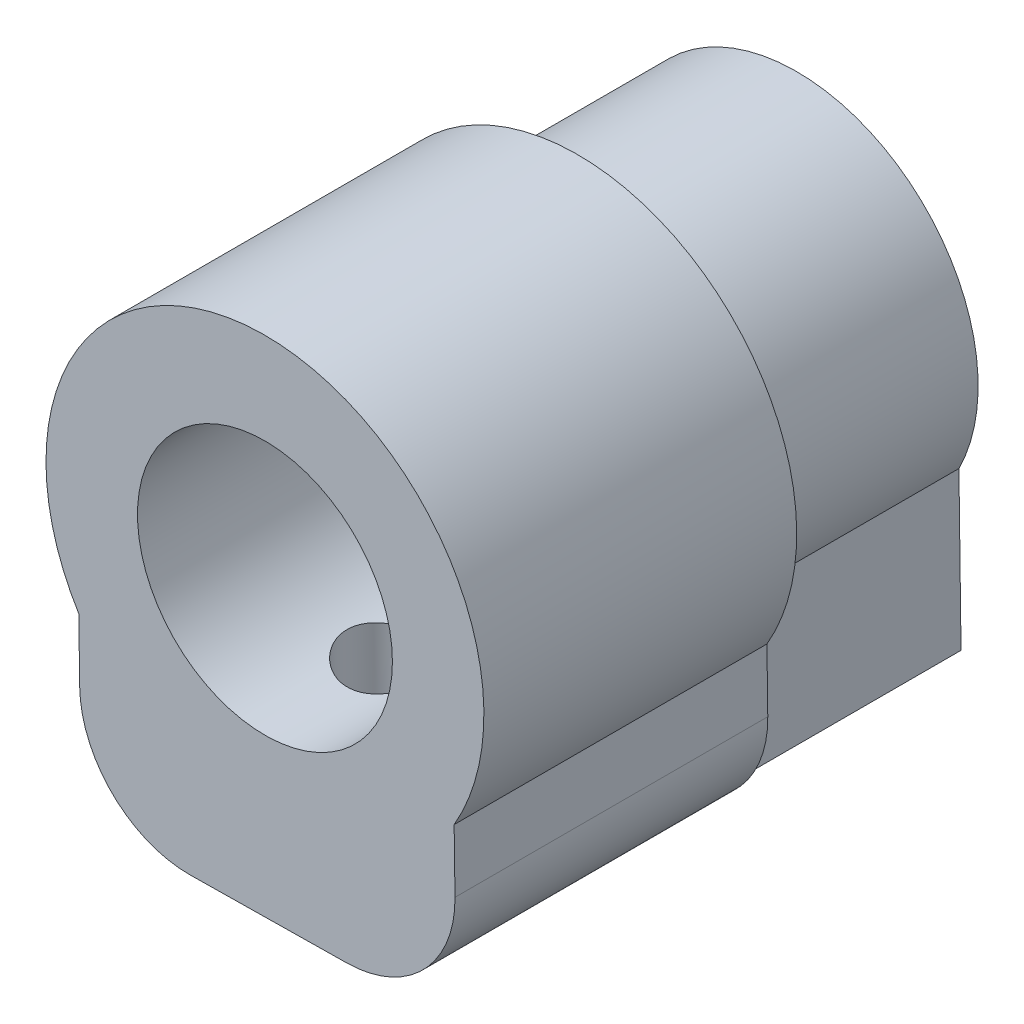
ISO-10303-21;
HEADER;
FILE_DESCRIPTION(('STEP AP214'),'2;1');
FILE_NAME('part.step','',(''),(''),'','','');
FILE_SCHEMA(('AUTOMOTIVE_DESIGN { 1 0 10303 214 1 1 1 1 }'));
ENDSEC;
DATA;
#1=APPLICATION_CONTEXT('core data for automotive mechanical design processes');
#2=APPLICATION_PROTOCOL_DEFINITION('international standard','automotive_design',2000,#1);
#3=PRODUCT_CONTEXT('',#1,'mechanical');
#4=PRODUCT('Part','Part','',(#3));
#5=PRODUCT_RELATED_PRODUCT_CATEGORY('part','',(#4));
#6=PRODUCT_DEFINITION_FORMATION('','',#4);
#7=PRODUCT_DEFINITION_CONTEXT('part definition',#1,'design');
#8=PRODUCT_DEFINITION('design','',#6,#7);
#9=PRODUCT_DEFINITION_SHAPE('','',#8);
#10=(LENGTH_UNIT() NAMED_UNIT(*) SI_UNIT(.MILLI.,.METRE.));
#11=(NAMED_UNIT(*) PLANE_ANGLE_UNIT() SI_UNIT($,.RADIAN.));
#12=(NAMED_UNIT(*) SI_UNIT($,.STERADIAN.) SOLID_ANGLE_UNIT());
#13=UNCERTAINTY_MEASURE_WITH_UNIT(LENGTH_MEASURE(1.E-05),#10,'distance_accuracy_value','');
#14=(GEOMETRIC_REPRESENTATION_CONTEXT(3) GLOBAL_UNCERTAINTY_ASSIGNED_CONTEXT((#13)) GLOBAL_UNIT_ASSIGNED_CONTEXT((#10,
#11,#12)) REPRESENTATION_CONTEXT('',''));
#15=CARTESIAN_POINT('',(0.,0.,0.));
#16=DIRECTION('',(0.,0.,1.));
#17=DIRECTION('',(1.,0.,0.));
#18=AXIS2_PLACEMENT_3D('',#15,#16,#17);
#19=CARTESIAN_POINT('',(-2.55957107471115,-7.6755821211275,17.));
#20=DIRECTION('',(0.,0.,1.));
#21=DIRECTION('',(1.,0.,0.));
#22=AXIS2_PLACEMENT_3D('',#19,#20,#21);
#23=CYLINDRICAL_SURFACE('',#22,3.5);
#24=DIRECTION('',(0.,0.,-1.));
#25=VECTOR('',#24,1.);
#26=CARTESIAN_POINT('',(-2.51223815929291,-11.175262048652,17.));
#27=LINE('',#26,#25);
#28=CARTESIAN_POINT('',(-2.51223815929291,-11.175262048652,17.));
#29=VERTEX_POINT('',#28);
#30=CARTESIAN_POINT('',(-2.51223815929291,-11.175262048652,7.));
#31=VERTEX_POINT('',#30);
#32=EDGE_CURVE('E228',#29,#31,#27,.T.);
#33=ORIENTED_EDGE('',*,*,#32,.F.);
#34=CARTESIAN_POINT('',(-2.55957107471115,-7.6755821211275,17.));
#35=DIRECTION('',(0.,0.,1.));
#36=DIRECTION('',(1.,0.,0.));
#37=AXIS2_PLACEMENT_3D('',#34,#35,#36);
#38=CIRCLE('',#37,3.5);
#39=CARTESIAN_POINT('',(-6.05925100223567,-7.72291503654575,17.));
#40=VERTEX_POINT('',#39);
#41=EDGE_CURVE('E44',#40,#29,#38,.T.);
#42=ORIENTED_EDGE('',*,*,#41,.F.);
#43=DIRECTION('',(0.,0.,-1.));
#44=VECTOR('',#43,1.);
#45=CARTESIAN_POINT('',(-6.05925100223567,-7.72291503654574,17.));
#46=LINE('',#45,#44);
#47=CARTESIAN_POINT('',(-6.05925100223567,-7.72291503654575,7.));
#48=VERTEX_POINT('',#47);
#49=EDGE_CURVE('E231',#48,#40,#46,.F.);
#50=ORIENTED_EDGE('',*,*,#49,.F.);
#51=CARTESIAN_POINT('',(-2.55957107471115,-7.6755821211275,7.));
#52=DIRECTION('',(0.,0.,1.));
#53=DIRECTION('',(1.,0.,0.));
#54=AXIS2_PLACEMENT_3D('',#51,#52,#53);
#55=CIRCLE('',#54,3.5);
#56=EDGE_CURVE('E11',#31,#48,#55,.F.);
#57=ORIENTED_EDGE('',*,*,#56,.F.);
#58=EDGE_LOOP('',(#33,#42,#50,#57));
#59=FACE_BOUND('',#58,.T.);
#60=ADVANCED_FACE('F37',(#59),#23,.T.);
#61=CARTESIAN_POINT('',(2.4399716788953,-7.60796367053002,17.));
#62=DIRECTION('',(0.,0.,-1.));
#63=DIRECTION('',(-1.,0.,0.));
#64=AXIS2_PLACEMENT_3D('',#61,#62,#63);
#65=CYLINDRICAL_SURFACE('',#64,3.5);
#66=DIRECTION('',(0.,0.,-1.));
#67=VECTOR('',#66,1.);
#68=CARTESIAN_POINT('',(5.93965160641982,-7.56063075511178,17.));
#69=LINE('',#68,#67);
#70=CARTESIAN_POINT('',(5.93965160641982,-7.56063075511178,17.));
#71=VERTEX_POINT('',#70);
#72=CARTESIAN_POINT('',(5.93965160641982,-7.56063075511178,7.));
#73=VERTEX_POINT('',#72);
#74=EDGE_CURVE('E192',#71,#73,#69,.T.);
#75=ORIENTED_EDGE('',*,*,#74,.F.);
#76=CARTESIAN_POINT('',(2.4399716788953,-7.60796367053002,17.));
#77=DIRECTION('',(0.,0.,1.));
#78=DIRECTION('',(1.,0.,0.));
#79=AXIS2_PLACEMENT_3D('',#76,#77,#78);
#80=CIRCLE('',#79,3.5);
#81=CARTESIAN_POINT('',(2.48730459431354,-11.1076435980545,17.));
#82=VERTEX_POINT('',#81);
#83=EDGE_CURVE('E136',#82,#71,#80,.T.);
#84=ORIENTED_EDGE('',*,*,#83,.F.);
#85=DIRECTION('',(0.,0.,-1.));
#86=VECTOR('',#85,1.);
#87=CARTESIAN_POINT('',(2.48730459431354,-11.1076435980545,17.));
#88=LINE('',#87,#86);
#89=CARTESIAN_POINT('',(2.48730459431354,-11.1076435980545,7.));
#90=VERTEX_POINT('',#89);
#91=EDGE_CURVE('E237',#90,#82,#88,.F.);
#92=ORIENTED_EDGE('',*,*,#91,.F.);
#93=CARTESIAN_POINT('',(2.4399716788953,-7.60796367053002,7.));
#94=DIRECTION('',(0.,0.,1.));
#95=DIRECTION('',(1.,0.,0.));
#96=AXIS2_PLACEMENT_3D('',#93,#94,#95);
#97=CIRCLE('',#96,3.5);
#98=EDGE_CURVE('E232',#73,#90,#97,.F.);
#99=ORIENTED_EDGE('',*,*,#98,.F.);
#100=EDGE_LOOP('',(#75,#84,#92,#99));
#101=FACE_BOUND('',#100,.T.);
#102=ADVANCED_FACE('F221',(#101),#65,.T.);
#103=CARTESIAN_POINT('',(4.98687572108652,0.0674471299078352,7.));
#104=DIRECTION('',(0.999908550721291,0.0135236901195044,0.));
#105=DIRECTION('',(-0.0135236901195044,0.999908550721291,0.));
#106=AXIS2_PLACEMENT_3D('',#103,#104,#105);
#107=PLANE('',#106);
#108=DIRECTION('',(0.0135236901195044,-0.999908550721291,0.));
#109=VECTOR('',#108,1.);
#110=CARTESIAN_POINT('',(4.98687572108652,0.0674471299078352,0.));
#111=LINE('',#110,#109);
#112=CARTESIAN_POINT('',(5.05045283259864,-4.63328890214981,0.));
#113=VERTEX_POINT('',#112);
#114=CARTESIAN_POINT('',(5.11807746742024,-9.63328890214981,0.));
#115=VERTEX_POINT('',#114);
#116=EDGE_CURVE('E121',#113,#115,#111,.T.);
#117=ORIENTED_EDGE('',*,*,#116,.F.);
#118=DIRECTION('',(0.,0.,-1.));
#119=VECTOR('',#118,1.);
#120=CARTESIAN_POINT('',(5.05045283259864,-4.63328890214981,7.));
#121=LINE('',#120,#119);
#122=CARTESIAN_POINT('',(5.05045283259864,-4.63328890214981,7.));
#123=VERTEX_POINT('',#122);
#124=EDGE_CURVE('E187',#123,#113,#121,.T.);
#125=ORIENTED_EDGE('',*,*,#124,.F.);
#126=DIRECTION('',(0.0135236901195044,-0.999908550721291,0.));
#127=VECTOR('',#126,1.);
#128=CARTESIAN_POINT('',(4.98687572108652,0.0674471299078352,7.));
#129=LINE('',#128,#127);
#130=CARTESIAN_POINT('',(5.11807746742024,-9.63328890214981,7.));
#131=VERTEX_POINT('',#130);
#132=EDGE_CURVE('E159',#123,#131,#129,.T.);
#133=ORIENTED_EDGE('',*,*,#132,.T.);
#134=DIRECTION('',(0.,0.,-1.));
#135=VECTOR('',#134,1.);
#136=CARTESIAN_POINT('',(5.11807746742024,-9.63328890214981,7.));
#137=LINE('',#136,#135);
#138=EDGE_CURVE('E171',#131,#115,#137,.T.);
#139=ORIENTED_EDGE('',*,*,#138,.T.);
#140=EDGE_LOOP('',(#117,#125,#133,#139));
#141=FACE_BOUND('',#140,.T.);
#142=ADVANCED_FACE('F225',(#141),#107,.T.);
#143=CARTESIAN_POINT('',(-0.135614238952738,-2.03623127295278,7.));
#144=DIRECTION('',(0.,0.,-1.));
#145=DIRECTION('',(-1.,0.,0.));
#146=AXIS2_PLACEMENT_3D('',#143,#144,#145);
#147=CYLINDRICAL_SURFACE('',#146,5.8);
#148=CARTESIAN_POINT('',(-0.135614238952738,-2.03623127295278,0.));
#149=DIRECTION('',(0.,0.,1.));
#150=DIRECTION('',(1.,0.,0.));
#151=AXIS2_PLACEMENT_3D('',#148,#149,#150);
#152=CIRCLE('',#151,5.8);
#153=CARTESIAN_POINT('',(-5.24954716740136,-4.77259564988231,0.));
#154=VERTEX_POINT('',#153);
#155=EDGE_CURVE('E174',#113,#154,#152,.T.);
#156=ORIENTED_EDGE('',*,*,#155,.T.);
#157=DIRECTION('',(0.,0.,-1.));
#158=VECTOR('',#157,1.);
#159=CARTESIAN_POINT('',(-5.24954716740136,-4.77259564988231,7.));
#160=LINE('',#159,#158);
#161=CARTESIAN_POINT('',(-5.24954716740136,-4.77259564988231,7.));
#162=VERTEX_POINT('',#161);
#163=EDGE_CURVE('E184',#162,#154,#160,.T.);
#164=ORIENTED_EDGE('',*,*,#163,.F.);
#165=CARTESIAN_POINT('',(-0.135614238952738,-2.03623127295278,7.));
#166=DIRECTION('',(0.,0.,1.));
#167=DIRECTION('',(1.,0.,0.));
#168=AXIS2_PLACEMENT_3D('',#165,#166,#167);
#169=CIRCLE('',#168,5.8);
#170=EDGE_CURVE('E161',#123,#162,#169,.T.);
#171=ORIENTED_EDGE('',*,*,#170,.F.);
#172=ORIENTED_EDGE('',*,*,#124,.T.);
#173=EDGE_LOOP('',(#156,#164,#171,#172));
#174=FACE_BOUND('',#173,.T.);
#175=ADVANCED_FACE('F265',(#174),#147,.T.);
#176=CARTESIAN_POINT('',(-5.31312427891349,-0.0718596178246597,7.));
#177=DIRECTION('',(0.999908550721291,0.0135236901195044,0.));
#178=DIRECTION('',(-0.0135236901195044,0.999908550721291,0.));
#179=AXIS2_PLACEMENT_3D('',#176,#177,#178);
#180=PLANE('',#179);
#181=DIRECTION('',(0.0135236901195044,-0.999908550721291,0.));
#182=VECTOR('',#181,1.);
#183=CARTESIAN_POINT('',(-5.31312427891349,-0.0718596178246597,0.));
#184=LINE('',#183,#182);
#185=CARTESIAN_POINT('',(-5.18192253257976,-9.77259564988231,0.));
#186=VERTEX_POINT('',#185);
#187=EDGE_CURVE('E176',#154,#186,#184,.T.);
#188=ORIENTED_EDGE('',*,*,#187,.T.);
#189=DIRECTION('',(0.,0.,-1.));
#190=VECTOR('',#189,1.);
#191=CARTESIAN_POINT('',(-5.18192253257976,-9.77259564988231,7.));
#192=LINE('',#191,#190);
#193=CARTESIAN_POINT('',(-5.18192253257976,-9.77259564988231,7.));
#194=VERTEX_POINT('',#193);
#195=EDGE_CURVE('E181',#194,#186,#192,.T.);
#196=ORIENTED_EDGE('',*,*,#195,.F.);
#197=DIRECTION('',(0.0135236901195044,-0.999908550721291,0.));
#198=VECTOR('',#197,1.);
#199=CARTESIAN_POINT('',(-5.31312427891349,-0.0718596178246597,7.));
#200=LINE('',#199,#198);
#201=EDGE_CURVE('E165',#162,#194,#200,.T.);
#202=ORIENTED_EDGE('',*,*,#201,.F.);
#203=ORIENTED_EDGE('',*,*,#163,.T.);
#204=EDGE_LOOP('',(#188,#196,#202,#203));
#205=FACE_BOUND('',#204,.T.);
#206=ADVANCED_FACE('F261',(#205),#180,.F.);
#207=CARTESIAN_POINT('',(0.131201746333726,-9.70073603205765,7.));
#208=DIRECTION('',(-0.0135236901195044,0.999908550721291,0.));
#209=DIRECTION('',(-0.999908550721291,-0.0135236901195044,0.));
#210=AXIS2_PLACEMENT_3D('',#207,#208,#209);
#211=PLANE('',#210);
#212=DIRECTION('',(0.999908550721291,0.0135236901195044,0.));
#213=VECTOR('',#212,1.);
#214=CARTESIAN_POINT('',(0.131201746333726,-9.70073603205765,0.));
#215=LINE('',#214,#213);
#216=EDGE_CURVE('E162',#186,#115,#215,.T.);
#217=ORIENTED_EDGE('',*,*,#216,.T.);
#218=ORIENTED_EDGE('',*,*,#138,.F.);
#219=DIRECTION('',(0.999908550721291,0.0135236901195044,0.));
#220=VECTOR('',#219,1.);
#221=CARTESIAN_POINT('',(0.131201746333726,-9.70073603205765,7.));
#222=LINE('',#221,#220);
#223=EDGE_CURVE('E168',#194,#131,#222,.T.);
#224=ORIENTED_EDGE('',*,*,#223,.F.);
#225=ORIENTED_EDGE('',*,*,#195,.T.);
#226=EDGE_LOOP('',(#217,#218,#224,#225));
#227=FACE_BOUND('',#226,.T.);
#228=ADVANCED_FACE('F257',(#227),#211,.F.);
#229=CARTESIAN_POINT('',(0.,0.,0.));
#230=DIRECTION('',(0.,0.,1.));
#231=DIRECTION('',(1.,0.,0.));
#232=AXIS2_PLACEMENT_3D('',#229,#230,#231);
#233=PLANE('',#232);
#234=ORIENTED_EDGE('',*,*,#116,.T.);
#235=ORIENTED_EDGE('',*,*,#216,.F.);
#236=ORIENTED_EDGE('',*,*,#187,.F.);
#237=ORIENTED_EDGE('',*,*,#155,.F.);
#238=EDGE_LOOP('',(#234,#235,#236,#237));
#239=FACE_BOUND('',#238,.T.);
#240=ADVANCED_FACE('F253',(#239),#233,.F.);
#241=CARTESIAN_POINT('',(5.83632702541427,0.0789358967585724,17.));
#242=DIRECTION('',(0.999908550721291,0.0135236901194972,0.));
#243=DIRECTION('',(-0.0135236901194972,0.999908550721291,0.));
#244=AXIS2_PLACEMENT_3D('',#241,#242,#243);
#245=PLANE('',#244);
#246=DIRECTION('',(0.0135236901194972,-0.999908550721291,0.));
#247=VECTOR('',#246,1.);
#248=CARTESIAN_POINT('',(5.83632702541427,0.0789358967585724,17.));
#249=LINE('',#248,#247);
#250=CARTESIAN_POINT('',(5.91259742353434,-5.5603106826363,17.));
#251=VERTEX_POINT('',#250);
#252=EDGE_CURVE('E116',#251,#71,#249,.T.);
#253=ORIENTED_EDGE('',*,*,#252,.T.);
#254=ORIENTED_EDGE('',*,*,#74,.T.);
#255=DIRECTION('',(0.0135236901194972,-0.999908550721291,0.));
#256=VECTOR('',#255,1.);
#257=CARTESIAN_POINT('',(5.83632702541427,0.0789358967585724,7.));
#258=LINE('',#257,#256);
#259=CARTESIAN_POINT('',(5.91259742353434,-5.5603106826363,7.));
#260=VERTEX_POINT('',#259);
#261=EDGE_CURVE('E118',#260,#73,#258,.T.);
#262=ORIENTED_EDGE('',*,*,#261,.F.);
#263=DIRECTION('',(0.,0.,-1.));
#264=VECTOR('',#263,1.);
#265=CARTESIAN_POINT('',(5.91259742353434,-5.5603106826363,17.));
#266=LINE('',#265,#264);
#267=EDGE_CURVE('E111',#251,#260,#266,.T.);
#268=ORIENTED_EDGE('',*,*,#267,.F.);
#269=EDGE_LOOP('',(#253,#254,#262,#268));
#270=FACE_BOUND('',#269,.T.);
#271=ADVANCED_FACE('F113',(#270),#245,.T.);
#272=CARTESIAN_POINT('',(-0.135614238952738,-2.03623127295278,17.));
#273=DIRECTION('',(0.,0.,-1.));
#274=DIRECTION('',(-1.,0.,0.));
#275=AXIS2_PLACEMENT_3D('',#272,#273,#274);
#276=CYLINDRICAL_SURFACE('',#275,7.);
#277=CARTESIAN_POINT('',(-0.135614238952738,-2.03623127295278,7.));
#278=DIRECTION('',(0.,0.,1.));
#279=DIRECTION('',(1.,0.,0.));
#280=AXIS2_PLACEMENT_3D('',#277,#278,#279);
#281=CIRCLE('',#280,7.);
#282=CARTESIAN_POINT('',(-6.08630518512115,-5.72259496407026,7.));
#283=VERTEX_POINT('',#282);
#284=EDGE_CURVE('E153',#260,#283,#281,.T.);
#285=ORIENTED_EDGE('',*,*,#284,.T.);
#286=DIRECTION('',(0.,0.,-1.));
#287=VECTOR('',#286,1.);
#288=CARTESIAN_POINT('',(-6.08630518512115,-5.72259496407026,17.));
#289=LINE('',#288,#287);
#290=CARTESIAN_POINT('',(-6.08630518512115,-5.72259496407026,17.));
#291=VERTEX_POINT('',#290);
#292=EDGE_CURVE('E122',#291,#283,#289,.T.);
#293=ORIENTED_EDGE('',*,*,#292,.F.);
#294=CARTESIAN_POINT('',(-0.135614238952738,-2.03623127295278,17.));
#295=DIRECTION('',(0.,0.,1.));
#296=DIRECTION('',(1.,0.,0.));
#297=AXIS2_PLACEMENT_3D('',#294,#295,#296);
#298=CIRCLE('',#297,7.);
#299=EDGE_CURVE('E125',#251,#291,#298,.T.);
#300=ORIENTED_EDGE('',*,*,#299,.F.);
#301=ORIENTED_EDGE('',*,*,#267,.T.);
#302=EDGE_LOOP('',(#285,#293,#300,#301));
#303=FACE_BOUND('',#302,.T.);
#304=ADVANCED_FACE('F126',(#303),#276,.T.);
#305=CARTESIAN_POINT('',(-6.16257558324121,-0.083348384675396,17.));
#306=DIRECTION('',(0.999908550721291,0.0135236901194975,0.));
#307=DIRECTION('',(-0.0135236901194975,0.999908550721291,0.));
#308=AXIS2_PLACEMENT_3D('',#305,#306,#307);
#309=PLANE('',#308);
#310=DIRECTION('',(0.0135236901194975,-0.999908550721291,0.));
#311=VECTOR('',#310,1.);
#312=CARTESIAN_POINT('',(-6.16257558324121,-0.083348384675396,7.));
#313=LINE('',#312,#311);
#314=EDGE_CURVE('E140',#283,#48,#313,.T.);
#315=ORIENTED_EDGE('',*,*,#314,.T.);
#316=ORIENTED_EDGE('',*,*,#49,.T.);
#317=DIRECTION('',(0.0135236901194975,-0.999908550721291,0.));
#318=VECTOR('',#317,1.);
#319=CARTESIAN_POINT('',(-6.16257558324121,-0.083348384675396,17.));
#320=LINE('',#319,#318);
#321=EDGE_CURVE('E131',#291,#40,#320,.T.);
#322=ORIENTED_EDGE('',*,*,#321,.F.);
#323=ORIENTED_EDGE('',*,*,#292,.T.);
#324=EDGE_LOOP('',(#315,#316,#322,#323));
#325=FACE_BOUND('',#324,.T.);
#326=ADVANCED_FACE('F242',(#325),#309,.F.);
#327=CARTESIAN_POINT('',(0.150657496423787,-11.1392465793949,17.));
#328=DIRECTION('',(0.0135236901194974,-0.999908550721291,0.));
#329=DIRECTION('',(0.999908550721291,0.0135236901194974,0.));
#330=AXIS2_PLACEMENT_3D('',#327,#328,#329);
#331=PLANE('',#330);
#332=CARTESIAN_POINT('',(-0.090483682144648,-11.1425079962231,13.));
#333=DIRECTION('',(0.0135236901194975,-0.999908550721291,0.));
#334=DIRECTION('',(0.999908550721291,0.0135236901194975,0.));
#335=AXIS2_PLACEMENT_3D('',#332,#333,#334);
#336=CIRCLE('',#335,1.35);
#337=CARTESIAN_POINT('',(1.25939286132909,-11.1242510145618,13.));
#338=VERTEX_POINT('',#337);
#339=EDGE_CURVE('E143',#338,#338,#336,.T.);
#340=ORIENTED_EDGE('',*,*,#339,.F.);
#341=EDGE_LOOP('',(#340));
#342=FACE_BOUND('',#341,.T.);
#343=DIRECTION('',(-0.999908550721291,-0.0135236901194974,0.));
#344=VECTOR('',#343,1.);
#345=CARTESIAN_POINT('',(0.150657496423787,-11.1392465793949,17.));
#346=LINE('',#345,#344);
#347=EDGE_CURVE('E146',#82,#29,#346,.T.);
#348=ORIENTED_EDGE('',*,*,#347,.T.);
#349=ORIENTED_EDGE('',*,*,#32,.T.);
#350=DIRECTION('',(-0.999908550721291,-0.0135236901194974,0.));
#351=VECTOR('',#350,1.);
#352=CARTESIAN_POINT('',(0.150657496423787,-11.1392465793949,7.));
#353=LINE('',#352,#351);
#354=EDGE_CURVE('E138',#90,#31,#353,.T.);
#355=ORIENTED_EDGE('',*,*,#354,.F.);
#356=ORIENTED_EDGE('',*,*,#91,.T.);
#357=EDGE_LOOP('',(#348,#349,#355,#356));
#358=FACE_BOUND('',#357,.T.);
#359=ADVANCED_FACE('F235',(#342,#358),#331,.T.);
#360=CARTESIAN_POINT('',(-0.135614238952738,-2.03623127295278,17.));
#361=DIRECTION('',(0.,0.,-1.));
#362=DIRECTION('',(-1.,0.,0.));
#363=AXIS2_PLACEMENT_3D('',#360,#361,#362);
#364=CYLINDRICAL_SURFACE('',#363,4.075);
#365=CARTESIAN_POINT('',(1.18860095623821,-5.8900708021529,13.));
#366=CARTESIAN_POINT('',(1.18860115582861,-5.89007067717386,12.9261332767374));
#367=CARTESIAN_POINT('',(1.18254636778367,-5.8921671591529,12.8522676149466));
#368=CARTESIAN_POINT('',(1.15855707185826,-5.90028385509917,12.7067131659055));
#369=CARTESIAN_POINT('',(1.14062065774391,-5.90630469867058,12.6350247298897));
#370=CARTESIAN_POINT('',(1.09353616001728,-5.92151370896006,12.4959461553664));
#371=CARTESIAN_POINT('',(1.06440768388134,-5.93069633361886,12.4285487387534));
#372=CARTESIAN_POINT('',(0.99581442771469,-5.95117324151367,12.2995897975658));
#373=CARTESIAN_POINT('',(0.956347539368565,-5.96246795533407,12.2380294668413));
#374=CARTESIAN_POINT('',(0.866711843841012,-5.98631734214165,12.1203656729747));
#375=CARTESIAN_POINT('',(0.816245971822504,-5.99890043751559,12.0644941804885));
#376=CARTESIAN_POINT('',(0.70665414801684,-6.02363145234986,11.9618797314936));
#377=CARTESIAN_POINT('',(0.647527135652842,-6.03577931828828,11.9151378945704));
#378=CARTESIAN_POINT('',(0.520800177768026,-6.05853965008106,11.8312269389196));
#379=CARTESIAN_POINT('',(0.453055292444748,-6.06911683542031,11.7942663482561));
#380=CARTESIAN_POINT('',(0.311897895155108,-6.08720787921196,11.732371643195));
#381=CARTESIAN_POINT('',(0.23848696313787,-6.0947225879766,11.7074341901593));
#382=CARTESIAN_POINT('',(0.0908422777550258,-6.10558330916129,11.6711398730618));
#383=CARTESIAN_POINT('',(0.0167289078563331,-6.10906702847458,11.6593349617015));
#384=CARTESIAN_POINT('',(-0.132499818258903,-6.11191274125073,11.6481790181466));
#385=CARTESIAN_POINT('',(-0.207614949222909,-6.11127564621647,11.6488252318899));
#386=CARTESIAN_POINT('',(-0.353991372116104,-6.10601266791927,11.662262367908));
#387=CARTESIAN_POINT('',(-0.425296543617678,-6.10152414697899,11.6746365789693));
#388=CARTESIAN_POINT('',(-0.564757443185285,-6.08917650142444,11.710455501373));
#389=CARTESIAN_POINT('',(-0.632912881663991,-6.08131706756774,11.7339012284195));
#390=CARTESIAN_POINT('',(-0.76558011738415,-6.06281050799933,11.7916262859395));
#391=CARTESIAN_POINT('',(-0.830000969319213,-6.05211441416787,11.8260983558957));
#392=CARTESIAN_POINT('',(-0.952292942023687,-6.02904223625515,11.904741903958));
#393=CARTESIAN_POINT('',(-1.01016210301279,-6.01666565191771,11.9489162727167));
#394=CARTESIAN_POINT('',(-1.12069165554971,-5.990801709252,12.0482572555308));
#395=CARTESIAN_POINT('',(-1.17295854826162,-5.97728963288901,12.1038560134229));
#396=CARTESIAN_POINT('',(-1.26751772585723,-5.95118105968127,12.223180540757));
#397=CARTESIAN_POINT('',(-1.30980858301076,-5.93858469406762,12.2869074714622));
#398=CARTESIAN_POINT('',(-1.38357070533447,-5.91563123790509,12.4216615058044));
#399=CARTESIAN_POINT('',(-1.41491975188847,-5.90529989371205,12.4927602373064));
#400=CARTESIAN_POINT('',(-1.4649999039098,-5.88838213850876,12.6396849092521));
#401=CARTESIAN_POINT('',(-1.48373708483841,-5.88179392457485,12.7155085543214));
#402=CARTESIAN_POINT('',(-1.50718967850335,-5.87348982155507,12.8655425582686));
#403=CARTESIAN_POINT('',(-1.51257729017967,-5.87154055986263,12.9396350141305));
#404=CARTESIAN_POINT('',(-1.51107050821992,-5.87208147361462,13.087670154644));
#405=CARTESIAN_POINT('',(-1.50417846429218,-5.87457079973671,13.161612865239));
#406=CARTESIAN_POINT('',(-1.47888909355909,-5.88349058805656,13.3044018458783));
#407=CARTESIAN_POINT('',(-1.46092650470444,-5.88977195517024,13.373335468841));
#408=CARTESIAN_POINT('',(-1.41452887007781,-5.90541694054729,13.5072064888109));
#409=CARTESIAN_POINT('',(-1.38609187870231,-5.9147811314059,13.5721431407702));
#410=CARTESIAN_POINT('',(-1.31843481234544,-5.93595634932897,13.6986993790171));
#411=CARTESIAN_POINT('',(-1.27887135213865,-5.94784171005454,13.7601225931607));
#412=CARTESIAN_POINT('',(-1.19050860015119,-5.97259064298616,13.8757080176947));
#413=CARTESIAN_POINT('',(-1.14170636138447,-5.98545452653611,13.9298679017843));
#414=CARTESIAN_POINT('',(-1.03315292509614,-6.01157095519265,14.0324153648292));
#415=CARTESIAN_POINT('',(-0.972952812426773,-6.02480698069148,14.0803333526703));
#416=CARTESIAN_POINT('',(-0.84506613664317,-6.04952654883629,14.1654518733661));
#417=CARTESIAN_POINT('',(-0.77737958017978,-6.06101009303912,14.202652415742));
#418=CARTESIAN_POINT('',(-0.636490162518589,-6.08095497876188,14.2650633147311));
#419=CARTESIAN_POINT('',(-0.563303748942147,-6.08942492859822,14.2903078930165));
#420=CARTESIAN_POINT('',(-0.413377410899976,-6.10244871182918,14.3279985317411));
#421=CARTESIAN_POINT('',(-0.33663882608084,-6.10700400909624,14.3404493766993));
#422=CARTESIAN_POINT('',(-0.185783433177678,-6.11158739089176,14.3517375653147));
#423=CARTESIAN_POINT('',(-0.111719689199934,-6.1118240857326,14.3512051344141));
#424=CARTESIAN_POINT('',(0.0352238500245661,-6.10831169857994,14.3380555535608));
#425=CARTESIAN_POINT('',(0.108103774129317,-6.10456305337995,14.3254397279641));
#426=CARTESIAN_POINT('',(0.249070700312895,-6.09363710027754,14.2889525787953));
#427=CARTESIAN_POINT('',(0.317225931567375,-6.08653286730971,14.2653212777153));
#428=CARTESIAN_POINT('',(0.44862204410637,-6.06967710362719,14.2076481648352));
#429=CARTESIAN_POINT('',(0.511862139196013,-6.05992515051586,14.1736046918486));
#430=CARTESIAN_POINT('',(0.633884844271402,-6.03841333992312,14.094802535269));
#431=CARTESIAN_POINT('',(0.692456171932173,-6.02659858755675,14.0497319462955));
#432=CARTESIAN_POINT('',(0.801402608498024,-6.00243149555222,13.9506887263333));
#433=CARTESIAN_POINT('',(0.851775263282083,-5.99007899634675,13.8967134395879));
#434=CARTESIAN_POINT('',(0.944869143876344,-5.96568268988176,13.7789381966126));
#435=CARTESIAN_POINT('',(0.987223353948892,-5.95366883344382,13.7148410943428));
#436=CARTESIAN_POINT('',(1.06057835030772,-5.93189802609667,13.5800996651183));
#437=CARTESIAN_POINT('',(1.09158170949617,-5.92214056391456,13.5094568264434));
#438=CARTESIAN_POINT('',(1.14018003018597,-5.90645122324886,13.366621824159));
#439=CARTESIAN_POINT('',(1.15828159317459,-5.90037640030105,13.2946180596983));
#440=CARTESIAN_POINT('',(1.18249017487571,-5.8921868405581,13.1484087327367));
#441=CARTESIAN_POINT('',(1.18860075573694,-5.89007092770231,13.0742038307771));
#442=CARTESIAN_POINT('',(1.18860095623821,-5.8900708021529,13.));
#443=B_SPLINE_CURVE_WITH_KNOTS('',3,(#365,#366,#367,#368,#369,#370,#371,#372,#373,#374,#375,
#376,#377,#378,#379,#380,#381,#382,#383,#384,#385,#386,#387,#388,#389,#390,#391,#392,#393,#394,
#395,#396,#397,#398,#399,#400,#401,#402,#403,#404,#405,#406,#407,#408,#409,#410,#411,#412,#413,
#414,#415,#416,#417,#418,#419,#420,#421,#422,#423,#424,#425,#426,#427,#428,#429,#430,#431,#432,
#433,#434,#435,#436,#437,#438,#439,#440,#441,#442),.UNSPECIFIED.,.T.,.F.,(4,2,2,2,2,2,2,2,2,2,2,
2,2,2,2,2,2,2,2,2,2,2,2,2,2,2,2,2,2,2,2,2,2,2,2,2,2,2,4),(0.,0.221326748120709,
0.442689013497908,0.663665227590956,0.884686540557847,1.11264623920031,1.34063387541067,
1.57314890691097,1.80559933536851,2.02984963578523,2.25405033488769,2.47057221711609,
2.68711396698271,2.90766917332592,3.12829018009685,3.35970792982487,3.59115877906599,
3.82511786186123,4.05896415971046,4.28077175213848,4.50253690631003,4.71610399838158,
4.92971078022095,5.15081354714381,5.37198696063791,5.60510290896695,5.83821865020084,
6.07066304792534,6.3030204859027,6.52412248239064,6.7452002485842,6.96167115212686,
7.1781766100635,7.40170880686755,7.62530779133148,7.85747207121491,8.08958369369394,
8.31198659554587,8.53432341838846),.UNSPECIFIED.);
#444=CARTESIAN_POINT('',(1.18860095623821,-5.8900708021529,13.));
#445=VERTEX_POINT('',#444);
#446=EDGE_CURVE('E154',#445,#445,#443,.T.);
#447=ORIENTED_EDGE('',*,*,#446,.F.);
#448=EDGE_LOOP('',(#447));
#449=FACE_BOUND('',#448,.T.);
#450=CARTESIAN_POINT('',(-0.135614238952738,-2.03623127295278,17.));
#451=DIRECTION('',(0.,0.,1.));
#452=DIRECTION('',(1.,0.,0.));
#453=AXIS2_PLACEMENT_3D('',#450,#451,#452);
#454=CIRCLE('',#453,4.075);
#455=CARTESIAN_POINT('',(3.93938576104726,-2.03623127295278,17.));
#456=VERTEX_POINT('',#455);
#457=EDGE_CURVE('E149',#456,#456,#454,.T.);
#458=ORIENTED_EDGE('',*,*,#457,.T.);
#459=EDGE_LOOP('',(#458));
#460=FACE_BOUND('',#459,.T.);
#461=CARTESIAN_POINT('',(-0.135614238952738,-2.03623127295278,7.));
#462=DIRECTION('',(0.,0.,1.));
#463=DIRECTION('',(1.,0.,0.));
#464=AXIS2_PLACEMENT_3D('',#461,#462,#463);
#465=CIRCLE('',#464,4.075);
#466=CARTESIAN_POINT('',(3.93938576104726,-2.03623127295278,7.));
#467=VERTEX_POINT('',#466);
#468=EDGE_CURVE('E189',#467,#467,#465,.F.);
#469=ORIENTED_EDGE('',*,*,#468,.T.);
#470=EDGE_LOOP('',(#469));
#471=FACE_BOUND('',#470,.T.);
#472=ADVANCED_FACE('F200',(#449,#460,#471),#364,.F.);
#473=CARTESIAN_POINT('',(0.,0.,17.));
#474=DIRECTION('',(0.,0.,1.));
#475=DIRECTION('',(1.,0.,0.));
#476=AXIS2_PLACEMENT_3D('',#473,#474,#475);
#477=PLANE('',#476);
#478=ORIENTED_EDGE('',*,*,#321,.T.);
#479=ORIENTED_EDGE('',*,*,#41,.T.);
#480=ORIENTED_EDGE('',*,*,#347,.F.);
#481=ORIENTED_EDGE('',*,*,#83,.T.);
#482=ORIENTED_EDGE('',*,*,#252,.F.);
#483=ORIENTED_EDGE('',*,*,#299,.T.);
#484=EDGE_LOOP('',(#478,#479,#480,#481,#482,#483));
#485=FACE_BOUND('',#484,.T.);
#486=ORIENTED_EDGE('',*,*,#457,.F.);
#487=EDGE_LOOP('',(#486));
#488=FACE_BOUND('',#487,.T.);
#489=ADVANCED_FACE('F133',(#485,#488),#477,.T.);
#490=CARTESIAN_POINT('',(0.,0.,7.));
#491=DIRECTION('',(0.,0.,1.));
#492=DIRECTION('',(1.,0.,0.));
#493=AXIS2_PLACEMENT_3D('',#490,#491,#492);
#494=PLANE('',#493);
#495=ORIENTED_EDGE('',*,*,#132,.F.);
#496=ORIENTED_EDGE('',*,*,#170,.T.);
#497=ORIENTED_EDGE('',*,*,#201,.T.);
#498=ORIENTED_EDGE('',*,*,#223,.T.);
#499=EDGE_LOOP('',(#495,#496,#497,#498));
#500=FACE_BOUND('',#499,.T.);
#501=ORIENTED_EDGE('',*,*,#354,.T.);
#502=ORIENTED_EDGE('',*,*,#56,.T.);
#503=ORIENTED_EDGE('',*,*,#314,.F.);
#504=ORIENTED_EDGE('',*,*,#284,.F.);
#505=ORIENTED_EDGE('',*,*,#261,.T.);
#506=ORIENTED_EDGE('',*,*,#98,.T.);
#507=EDGE_LOOP('',(#501,#502,#503,#504,#505,#506));
#508=FACE_BOUND('',#507,.T.);
#509=ADVANCED_FACE('F211',(#500,#508),#494,.F.);
#510=CARTESIAN_POINT('',(0.,0.,7.));
#511=DIRECTION('',(0.,0.,1.));
#512=DIRECTION('',(1.,0.,0.));
#513=AXIS2_PLACEMENT_3D('',#510,#511,#512);
#514=PLANE('',#513);
#515=ORIENTED_EDGE('',*,*,#468,.F.);
#516=EDGE_LOOP('',(#515));
#517=FACE_BOUND('',#516,.T.);
#518=ADVANCED_FACE('F208',(#517),#514,.T.);
#519=CARTESIAN_POINT('',(-0.252767963578618,0.856394612432396,13.));
#520=DIRECTION('',(0.0135236901194975,-0.999908550721291,0.));
#521=DIRECTION('',(0.999908550721291,0.0135236901194975,0.));
#522=AXIS2_PLACEMENT_3D('',#519,#520,#521);
#523=CYLINDRICAL_SURFACE('',#522,1.35);
#524=ORIENTED_EDGE('',*,*,#446,.T.);
#525=EDGE_LOOP('',(#524));
#526=FACE_BOUND('',#525,.T.);
#527=ORIENTED_EDGE('',*,*,#339,.T.);
#528=EDGE_LOOP('',(#527));
#529=FACE_BOUND('',#528,.T.);
#530=ADVANCED_FACE('F204',(#526,#529),#523,.F.);
#531=CLOSED_SHELL('',(#60,#102,#142,#175,#206,#228,#240,#271,#304,#326,#359,#472,#489,#509,#518,#530));
#532=MANIFOLD_SOLID_BREP('B2',#531);
#533=ADVANCED_BREP_SHAPE_REPRESENTATION('',(#18,#532),#14);
#534=SHAPE_DEFINITION_REPRESENTATION(#9,#533);
ENDSEC;
END-ISO-10303-21;
